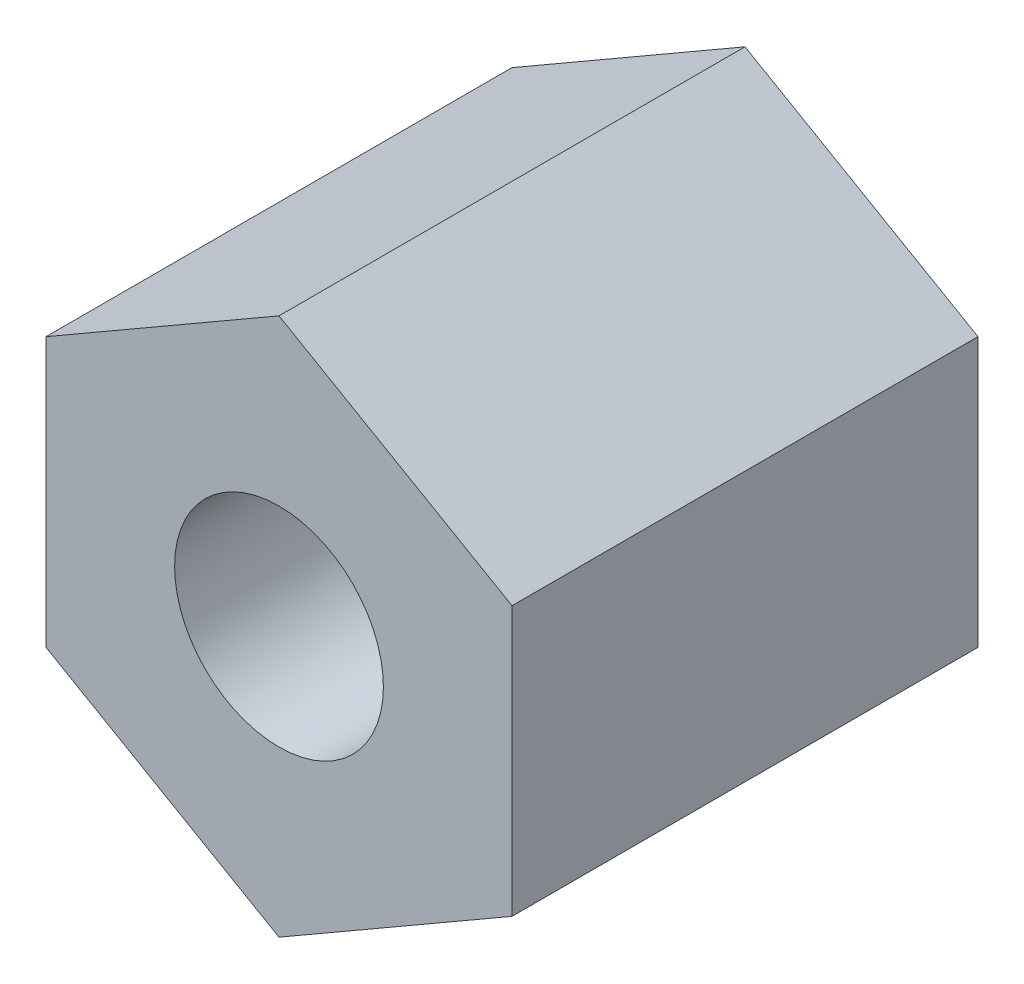
ISO-10303-21;
HEADER;
FILE_DESCRIPTION(('STEP AP214'),'2;1');
FILE_NAME('part.step','',(''),(''),'','','');
FILE_SCHEMA(('AUTOMOTIVE_DESIGN { 1 0 10303 214 1 1 1 1 }'));
ENDSEC;
DATA;
#1=APPLICATION_CONTEXT('core data for automotive mechanical design processes');
#2=APPLICATION_PROTOCOL_DEFINITION('international standard','automotive_design',2000,#1);
#3=PRODUCT_CONTEXT('',#1,'mechanical');
#4=PRODUCT('Part','Part','',(#3));
#5=PRODUCT_RELATED_PRODUCT_CATEGORY('part','',(#4));
#6=PRODUCT_DEFINITION_FORMATION('','',#4);
#7=PRODUCT_DEFINITION_CONTEXT('part definition',#1,'design');
#8=PRODUCT_DEFINITION('design','',#6,#7);
#9=PRODUCT_DEFINITION_SHAPE('','',#8);
#10=(LENGTH_UNIT() NAMED_UNIT(*) SI_UNIT(.MILLI.,.METRE.));
#11=(NAMED_UNIT(*) PLANE_ANGLE_UNIT() SI_UNIT($,.RADIAN.));
#12=(NAMED_UNIT(*) SI_UNIT($,.STERADIAN.) SOLID_ANGLE_UNIT());
#13=UNCERTAINTY_MEASURE_WITH_UNIT(LENGTH_MEASURE(1.E-05),#10,'distance_accuracy_value','');
#14=(GEOMETRIC_REPRESENTATION_CONTEXT(3) GLOBAL_UNCERTAINTY_ASSIGNED_CONTEXT((#13)) GLOBAL_UNIT_ASSIGNED_CONTEXT((#10,
#11,#12)) REPRESENTATION_CONTEXT('',''));
#15=CARTESIAN_POINT('',(0.,0.,0.));
#16=DIRECTION('',(0.,0.,1.));
#17=DIRECTION('',(1.,0.,0.));
#18=AXIS2_PLACEMENT_3D('',#15,#16,#17);
#19=CARTESIAN_POINT('',(0.,0.,6.35));
#20=DIRECTION('',(0.,0.,-1.));
#21=DIRECTION('',(-1.,0.,0.));
#22=AXIS2_PLACEMENT_3D('',#19,#20,#21);
#23=PLANE('',#22);
#24=DIRECTION('',(-0.866025403784439,-0.499999999999999,0.));
#25=VECTOR('',#24,1.);
#26=CARTESIAN_POINT('',(-3.175,1.83308710467706,6.35));
#27=LINE('',#26,#25);
#28=CARTESIAN_POINT('',(0.,3.66617420935412,6.35));
#29=VERTEX_POINT('',#28);
#30=CARTESIAN_POINT('',(-3.175,1.83308710467706,6.35));
#31=VERTEX_POINT('',#30);
#32=EDGE_CURVE('E134',#29,#31,#27,.T.);
#33=ORIENTED_EDGE('',*,*,#32,.T.);
#34=DIRECTION('',(0.,-1.,0.));
#35=VECTOR('',#34,1.);
#36=CARTESIAN_POINT('',(-3.175,-1.83308710467706,6.35));
#37=LINE('',#36,#35);
#38=CARTESIAN_POINT('',(-3.175,-1.83308710467706,6.35));
#39=VERTEX_POINT('',#38);
#40=EDGE_CURVE('E92',#31,#39,#37,.T.);
#41=ORIENTED_EDGE('',*,*,#40,.T.);
#42=DIRECTION('',(0.866025403784439,-0.5,0.));
#43=VECTOR('',#42,1.);
#44=CARTESIAN_POINT('',(0.,-3.66617420935412,6.35));
#45=LINE('',#44,#43);
#46=CARTESIAN_POINT('',(0.,-3.66617420935412,6.35));
#47=VERTEX_POINT('',#46);
#48=EDGE_CURVE('E105',#39,#47,#45,.T.);
#49=ORIENTED_EDGE('',*,*,#48,.T.);
#50=DIRECTION('',(0.866025403784439,0.5,0.));
#51=VECTOR('',#50,1.);
#52=CARTESIAN_POINT('',(3.175,-1.83308710467706,6.35));
#53=LINE('',#52,#51);
#54=CARTESIAN_POINT('',(3.175,-1.83308710467706,6.35));
#55=VERTEX_POINT('',#54);
#56=EDGE_CURVE('E99',#47,#55,#53,.T.);
#57=ORIENTED_EDGE('',*,*,#56,.T.);
#58=DIRECTION('',(0.,1.,0.));
#59=VECTOR('',#58,1.);
#60=CARTESIAN_POINT('',(3.175,1.83308710467706,6.35));
#61=LINE('',#60,#59);
#62=CARTESIAN_POINT('',(3.175,1.83308710467706,6.35));
#63=VERTEX_POINT('',#62);
#64=EDGE_CURVE('E103',#55,#63,#61,.T.);
#65=ORIENTED_EDGE('',*,*,#64,.T.);
#66=DIRECTION('',(-0.866025403784439,0.5,0.));
#67=VECTOR('',#66,1.);
#68=CARTESIAN_POINT('',(0.,3.66617420935412,6.35));
#69=LINE('',#68,#67);
#70=EDGE_CURVE('E55',#63,#29,#69,.T.);
#71=ORIENTED_EDGE('',*,*,#70,.T.);
#72=EDGE_LOOP('',(#33,#41,#49,#57,#65,#71));
#73=FACE_BOUND('',#72,.T.);
#74=CARTESIAN_POINT('',(0.,0.,6.35));
#75=DIRECTION('',(0.,0.,1.));
#76=DIRECTION('',(1.,0.,0.));
#77=AXIS2_PLACEMENT_3D('',#74,#75,#76);
#78=CIRCLE('',#77,1.4224);
#79=CARTESIAN_POINT('',(1.4224,0.,6.35));
#80=VERTEX_POINT('',#79);
#81=EDGE_CURVE('E127',#80,#80,#78,.T.);
#82=ORIENTED_EDGE('',*,*,#81,.F.);
#83=EDGE_LOOP('',(#82));
#84=FACE_BOUND('',#83,.T.);
#85=ADVANCED_FACE('F38',(#73,#84),#23,.F.);
#86=CARTESIAN_POINT('',(0.,0.,0.));
#87=DIRECTION('',(0.,0.,-1.));
#88=DIRECTION('',(-1.,0.,0.));
#89=AXIS2_PLACEMENT_3D('',#86,#87,#88);
#90=PLANE('',#89);
#91=DIRECTION('',(-0.866025403784439,-0.499999999999999,0.));
#92=VECTOR('',#91,1.);
#93=CARTESIAN_POINT('',(-3.175,1.83308710467706,0.));
#94=LINE('',#93,#92);
#95=CARTESIAN_POINT('',(0.,3.66617420935412,0.));
#96=VERTEX_POINT('',#95);
#97=CARTESIAN_POINT('',(-3.175,1.83308710467706,0.));
#98=VERTEX_POINT('',#97);
#99=EDGE_CURVE('E123',#96,#98,#94,.T.);
#100=ORIENTED_EDGE('',*,*,#99,.F.);
#101=DIRECTION('',(-0.866025403784439,0.5,0.));
#102=VECTOR('',#101,1.);
#103=CARTESIAN_POINT('',(0.,3.66617420935412,0.));
#104=LINE('',#103,#102);
#105=CARTESIAN_POINT('',(3.175,1.83308710467706,0.));
#106=VERTEX_POINT('',#105);
#107=EDGE_CURVE('E84',#106,#96,#104,.T.);
#108=ORIENTED_EDGE('',*,*,#107,.F.);
#109=DIRECTION('',(0.,1.,0.));
#110=VECTOR('',#109,1.);
#111=CARTESIAN_POINT('',(3.175,1.83308710467706,0.));
#112=LINE('',#111,#110);
#113=CARTESIAN_POINT('',(3.175,-1.83308710467706,0.));
#114=VERTEX_POINT('',#113);
#115=EDGE_CURVE('E78',#114,#106,#112,.T.);
#116=ORIENTED_EDGE('',*,*,#115,.F.);
#117=DIRECTION('',(0.866025403784439,0.5,0.));
#118=VECTOR('',#117,1.);
#119=CARTESIAN_POINT('',(3.175,-1.83308710467706,0.));
#120=LINE('',#119,#118);
#121=CARTESIAN_POINT('',(0.,-3.66617420935412,0.));
#122=VERTEX_POINT('',#121);
#123=EDGE_CURVE('E113',#122,#114,#120,.T.);
#124=ORIENTED_EDGE('',*,*,#123,.F.);
#125=DIRECTION('',(0.866025403784439,-0.5,0.));
#126=VECTOR('',#125,1.);
#127=CARTESIAN_POINT('',(0.,-3.66617420935412,0.));
#128=LINE('',#127,#126);
#129=CARTESIAN_POINT('',(-3.175,-1.83308710467706,0.));
#130=VERTEX_POINT('',#129);
#131=EDGE_CURVE('E129',#130,#122,#128,.T.);
#132=ORIENTED_EDGE('',*,*,#131,.F.);
#133=DIRECTION('',(0.,-1.,0.));
#134=VECTOR('',#133,1.);
#135=CARTESIAN_POINT('',(-3.175,-1.83308710467706,0.));
#136=LINE('',#135,#134);
#137=EDGE_CURVE('E126',#98,#130,#136,.T.);
#138=ORIENTED_EDGE('',*,*,#137,.F.);
#139=EDGE_LOOP('',(#100,#108,#116,#124,#132,#138));
#140=FACE_BOUND('',#139,.T.);
#141=CARTESIAN_POINT('',(0.,0.,0.));
#142=DIRECTION('',(0.,0.,1.));
#143=DIRECTION('',(1.,0.,0.));
#144=AXIS2_PLACEMENT_3D('',#141,#142,#143);
#145=CIRCLE('',#144,1.4224);
#146=CARTESIAN_POINT('',(1.4224,0.,0.));
#147=VERTEX_POINT('',#146);
#148=EDGE_CURVE('E227',#147,#147,#145,.T.);
#149=ORIENTED_EDGE('',*,*,#148,.T.);
#150=EDGE_LOOP('',(#149));
#151=FACE_BOUND('',#150,.T.);
#152=ADVANCED_FACE('F143',(#140,#151),#90,.T.);
#153=CARTESIAN_POINT('',(-3.175,1.83308710467706,6.35));
#154=DIRECTION('',(0.499999999999999,-0.866025403784439,0.));
#155=DIRECTION('',(0.866025403784439,0.499999999999999,0.));
#156=AXIS2_PLACEMENT_3D('',#153,#154,#155);
#157=PLANE('',#156);
#158=ORIENTED_EDGE('',*,*,#99,.T.);
#159=DIRECTION('',(0.,0.,-1.));
#160=VECTOR('',#159,1.);
#161=CARTESIAN_POINT('',(-3.175,1.83308710467706,6.35));
#162=LINE('',#161,#160);
#163=EDGE_CURVE('E11',#31,#98,#162,.T.);
#164=ORIENTED_EDGE('',*,*,#163,.F.);
#165=ORIENTED_EDGE('',*,*,#32,.F.);
#166=DIRECTION('',(0.,0.,-1.));
#167=VECTOR('',#166,1.);
#168=CARTESIAN_POINT('',(0.,3.66617420935412,6.35));
#169=LINE('',#168,#167);
#170=EDGE_CURVE('E119',#29,#96,#169,.T.);
#171=ORIENTED_EDGE('',*,*,#170,.T.);
#172=EDGE_LOOP('',(#158,#164,#165,#171));
#173=FACE_BOUND('',#172,.T.);
#174=ADVANCED_FACE('F40',(#173),#157,.F.);
#175=CARTESIAN_POINT('',(-3.175,-1.83308710467706,6.35));
#176=DIRECTION('',(1.,0.,0.));
#177=DIRECTION('',(0.,0.,-1.));
#178=AXIS2_PLACEMENT_3D('',#175,#176,#177);
#179=PLANE('',#178);
#180=ORIENTED_EDGE('',*,*,#137,.T.);
#181=DIRECTION('',(0.,0.,-1.));
#182=VECTOR('',#181,1.);
#183=CARTESIAN_POINT('',(-3.175,-1.83308710467706,6.35));
#184=LINE('',#183,#182);
#185=EDGE_CURVE('E47',#39,#130,#184,.T.);
#186=ORIENTED_EDGE('',*,*,#185,.F.);
#187=ORIENTED_EDGE('',*,*,#40,.F.);
#188=ORIENTED_EDGE('',*,*,#163,.T.);
#189=EDGE_LOOP('',(#180,#186,#187,#188));
#190=FACE_BOUND('',#189,.T.);
#191=ADVANCED_FACE('F168',(#190),#179,.F.);
#192=CARTESIAN_POINT('',(0.,-3.66617420935412,6.35));
#193=DIRECTION('',(0.5,0.866025403784439,0.));
#194=DIRECTION('',(-0.866025403784439,0.5,0.));
#195=AXIS2_PLACEMENT_3D('',#192,#193,#194);
#196=PLANE('',#195);
#197=ORIENTED_EDGE('',*,*,#131,.T.);
#198=DIRECTION('',(0.,0.,-1.));
#199=VECTOR('',#198,1.);
#200=CARTESIAN_POINT('',(0.,-3.66617420935412,6.35));
#201=LINE('',#200,#199);
#202=EDGE_CURVE('E114',#47,#122,#201,.T.);
#203=ORIENTED_EDGE('',*,*,#202,.F.);
#204=ORIENTED_EDGE('',*,*,#48,.F.);
#205=ORIENTED_EDGE('',*,*,#185,.T.);
#206=EDGE_LOOP('',(#197,#203,#204,#205));
#207=FACE_BOUND('',#206,.T.);
#208=ADVANCED_FACE('F140',(#207),#196,.F.);
#209=CARTESIAN_POINT('',(3.175,-1.83308710467706,6.35));
#210=DIRECTION('',(-0.5,0.866025403784439,0.));
#211=DIRECTION('',(-0.866025403784439,-0.5,0.));
#212=AXIS2_PLACEMENT_3D('',#209,#210,#211);
#213=PLANE('',#212);
#214=ORIENTED_EDGE('',*,*,#123,.T.);
#215=DIRECTION('',(0.,0.,-1.));
#216=VECTOR('',#215,1.);
#217=CARTESIAN_POINT('',(3.175,-1.83308710467706,6.35));
#218=LINE('',#217,#216);
#219=EDGE_CURVE('E110',#55,#114,#218,.T.);
#220=ORIENTED_EDGE('',*,*,#219,.F.);
#221=ORIENTED_EDGE('',*,*,#56,.F.);
#222=ORIENTED_EDGE('',*,*,#202,.T.);
#223=EDGE_LOOP('',(#214,#220,#221,#222));
#224=FACE_BOUND('',#223,.T.);
#225=ADVANCED_FACE('F111',(#224),#213,.F.);
#226=CARTESIAN_POINT('',(3.175,1.83308710467706,6.35));
#227=DIRECTION('',(-1.,0.,0.));
#228=DIRECTION('',(0.,0.,1.));
#229=AXIS2_PLACEMENT_3D('',#226,#227,#228);
#230=PLANE('',#229);
#231=ORIENTED_EDGE('',*,*,#115,.T.);
#232=DIRECTION('',(0.,0.,-1.));
#233=VECTOR('',#232,1.);
#234=CARTESIAN_POINT('',(3.175,1.83308710467706,6.35));
#235=LINE('',#234,#233);
#236=EDGE_CURVE('E115',#63,#106,#235,.T.);
#237=ORIENTED_EDGE('',*,*,#236,.F.);
#238=ORIENTED_EDGE('',*,*,#64,.F.);
#239=ORIENTED_EDGE('',*,*,#219,.T.);
#240=EDGE_LOOP('',(#231,#237,#238,#239));
#241=FACE_BOUND('',#240,.T.);
#242=ADVANCED_FACE('F117',(#241),#230,.F.);
#243=CARTESIAN_POINT('',(0.,3.66617420935412,6.35));
#244=DIRECTION('',(-0.5,-0.866025403784439,0.));
#245=DIRECTION('',(0.866025403784439,-0.5,0.));
#246=AXIS2_PLACEMENT_3D('',#243,#244,#245);
#247=PLANE('',#246);
#248=ORIENTED_EDGE('',*,*,#107,.T.);
#249=ORIENTED_EDGE('',*,*,#170,.F.);
#250=ORIENTED_EDGE('',*,*,#70,.F.);
#251=ORIENTED_EDGE('',*,*,#236,.T.);
#252=EDGE_LOOP('',(#248,#249,#250,#251));
#253=FACE_BOUND('',#252,.T.);
#254=ADVANCED_FACE('F148',(#253),#247,.F.);
#255=CARTESIAN_POINT('',(0.,0.,6.35));
#256=DIRECTION('',(0.,0.,-1.));
#257=DIRECTION('',(-1.,0.,0.));
#258=AXIS2_PLACEMENT_3D('',#255,#256,#257);
#259=CYLINDRICAL_SURFACE('',#258,1.4224);
#260=ORIENTED_EDGE('',*,*,#81,.T.);
#261=EDGE_LOOP('',(#260));
#262=FACE_BOUND('',#261,.T.);
#263=ORIENTED_EDGE('',*,*,#148,.F.);
#264=EDGE_LOOP('',(#263));
#265=FACE_BOUND('',#264,.T.);
#266=ADVANCED_FACE('F150',(#262,#265),#259,.F.);
#267=CLOSED_SHELL('',(#85,#152,#174,#191,#208,#225,#242,#254,#266));
#268=MANIFOLD_SOLID_BREP('B2',#267);
#269=ADVANCED_BREP_SHAPE_REPRESENTATION('',(#18,#268),#14);
#270=SHAPE_DEFINITION_REPRESENTATION(#9,#269);
ENDSEC;
END-ISO-10303-21;
